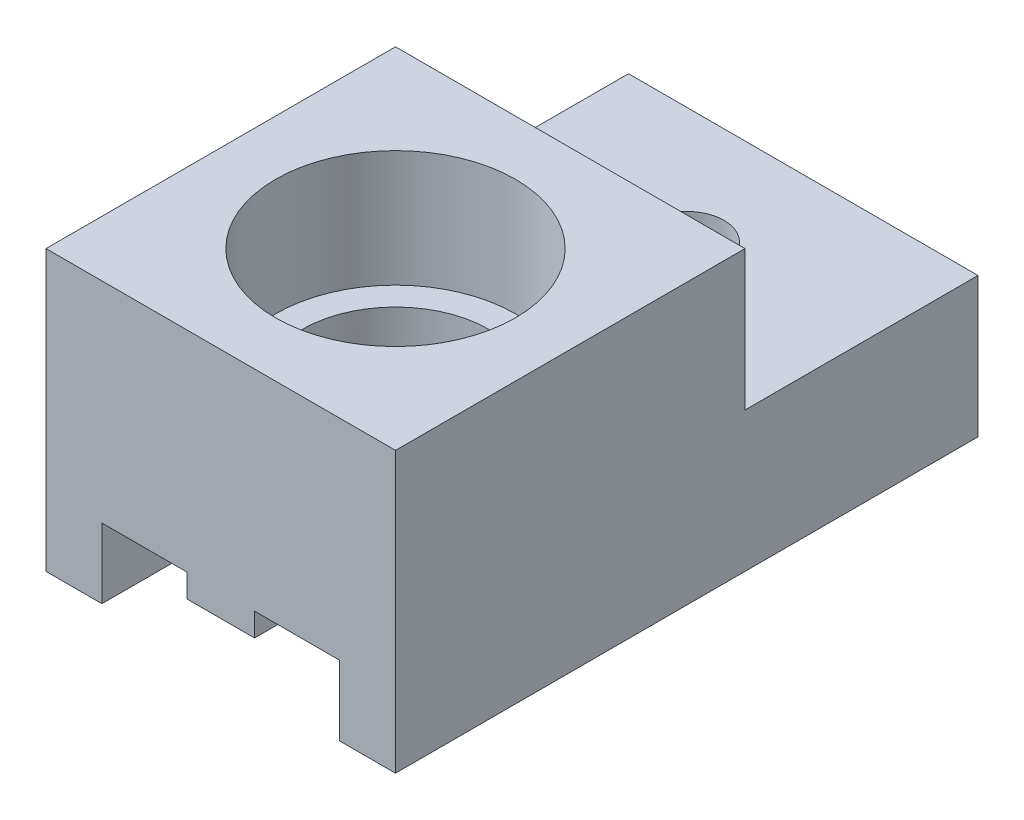
ISO-10303-21;
HEADER;
FILE_DESCRIPTION(('STEP AP214'),'2;1');
FILE_NAME('part.step','',(''),(''),'','','');
FILE_SCHEMA(('AUTOMOTIVE_DESIGN { 1 0 10303 214 1 1 1 1 }'));
ENDSEC;
DATA;
#1=APPLICATION_CONTEXT('core data for automotive mechanical design processes');
#2=APPLICATION_PROTOCOL_DEFINITION('international standard','automotive_design',2000,#1);
#3=PRODUCT_CONTEXT('',#1,'mechanical');
#4=PRODUCT('Part','Part','',(#3));
#5=PRODUCT_RELATED_PRODUCT_CATEGORY('part','',(#4));
#6=PRODUCT_DEFINITION_FORMATION('','',#4);
#7=PRODUCT_DEFINITION_CONTEXT('part definition',#1,'design');
#8=PRODUCT_DEFINITION('design','',#6,#7);
#9=PRODUCT_DEFINITION_SHAPE('','',#8);
#10=(LENGTH_UNIT() NAMED_UNIT(*) SI_UNIT(.MILLI.,.METRE.));
#11=(NAMED_UNIT(*) PLANE_ANGLE_UNIT() SI_UNIT($,.RADIAN.));
#12=(NAMED_UNIT(*) SI_UNIT($,.STERADIAN.) SOLID_ANGLE_UNIT());
#13=UNCERTAINTY_MEASURE_WITH_UNIT(LENGTH_MEASURE(1.E-05),#10,'distance_accuracy_value','');
#14=(GEOMETRIC_REPRESENTATION_CONTEXT(3) GLOBAL_UNCERTAINTY_ASSIGNED_CONTEXT((#13)) GLOBAL_UNIT_ASSIGNED_CONTEXT((#10,
#11,#12)) REPRESENTATION_CONTEXT('',''));
#15=CARTESIAN_POINT('',(0.,0.,0.));
#16=DIRECTION('',(0.,0.,1.));
#17=DIRECTION('',(1.,0.,0.));
#18=AXIS2_PLACEMENT_3D('',#15,#16,#17);
#19=CARTESIAN_POINT('',(-1.45,0.,25.));
#20=DIRECTION('',(1.,0.,0.));
#21=DIRECTION('',(0.,0.,-1.));
#22=AXIS2_PLACEMENT_3D('',#19,#20,#21);
#23=PLANE('',#22);
#24=DIRECTION('',(0.,0.,-1.));
#25=VECTOR('',#24,1.);
#26=CARTESIAN_POINT('',(-1.45,-1.,25.));
#27=LINE('',#26,#25);
#28=CARTESIAN_POINT('',(-1.45,-1.,4.32361253707657));
#29=VERTEX_POINT('',#28);
#30=CARTESIAN_POINT('',(-1.45,-1.,0.));
#31=VERTEX_POINT('',#30);
#32=EDGE_CURVE('E344',#29,#31,#27,.T.);
#33=ORIENTED_EDGE('',*,*,#32,.F.);
#34=DIRECTION('',(0.,1.,0.));
#35=VECTOR('',#34,1.);
#36=CARTESIAN_POINT('',(-1.45,-3.,4.32361253707657));
#37=LINE('',#36,#35);
#38=CARTESIAN_POINT('',(-1.45,0.,4.32361253707657));
#39=VERTEX_POINT('',#38);
#40=EDGE_CURVE('E226',#29,#39,#37,.T.);
#41=ORIENTED_EDGE('',*,*,#40,.T.);
#42=DIRECTION('',(0.,0.,-1.));
#43=VECTOR('',#42,1.);
#44=CARTESIAN_POINT('',(-1.45,0.,25.));
#45=LINE('',#44,#43);
#46=CARTESIAN_POINT('',(-1.45,0.,0.));
#47=VERTEX_POINT('',#46);
#48=EDGE_CURVE('E43',#39,#47,#45,.T.);
#49=ORIENTED_EDGE('',*,*,#48,.T.);
#50=DIRECTION('',(0.,-1.,0.));
#51=VECTOR('',#50,1.);
#52=CARTESIAN_POINT('',(-1.45,0.,0.));
#53=LINE('',#52,#51);
#54=EDGE_CURVE('E293',#47,#31,#53,.T.);
#55=ORIENTED_EDGE('',*,*,#54,.T.);
#56=EDGE_LOOP('',(#33,#41,#49,#55));
#57=FACE_BOUND('',#56,.T.);
#58=ADVANCED_FACE('F33',(#57),#23,.F.);
#59=CARTESIAN_POINT('',(-1.45,-1.,25.));
#60=DIRECTION('',(0.,1.,0.));
#61=DIRECTION('',(-1.,0.,0.));
#62=AXIS2_PLACEMENT_3D('',#59,#60,#61);
#63=PLANE('',#62);
#64=CARTESIAN_POINT('',(-1.45,-1.,13.7720649147283));
#65=VERTEX_POINT('',#64);
#66=CARTESIAN_POINT('',(-1.45,-1.,5.67638746292343));
#67=VERTEX_POINT('',#66);
#68=EDGE_CURVE('E348',#65,#67,#27,.T.);
#69=ORIENTED_EDGE('',*,*,#68,.T.);
#70=CARTESIAN_POINT('',(0.,-1.,5.));
#71=DIRECTION('',(0.,1.,0.));
#72=DIRECTION('',(-1.,0.,0.));
#73=AXIS2_PLACEMENT_3D('',#70,#71,#72);
#74=CIRCLE('',#73,1.6);
#75=CARTESIAN_POINT('',(1.45,-1.,5.67638746292343));
#76=VERTEX_POINT('',#75);
#77=EDGE_CURVE('E222',#67,#76,#74,.T.);
#78=ORIENTED_EDGE('',*,*,#77,.T.);
#79=DIRECTION('',(0.,0.,-1.));
#80=VECTOR('',#79,1.);
#81=CARTESIAN_POINT('',(1.45,-1.,25.));
#82=LINE('',#81,#80);
#83=CARTESIAN_POINT('',(1.45,-1.,13.7720649147283));
#84=VERTEX_POINT('',#83);
#85=EDGE_CURVE('E345',#84,#76,#82,.T.);
#86=ORIENTED_EDGE('',*,*,#85,.F.);
#87=CARTESIAN_POINT('',(0.,-1.,17.5));
#88=DIRECTION('',(0.,1.,0.));
#89=DIRECTION('',(-1.,0.,0.));
#90=AXIS2_PLACEMENT_3D('',#87,#88,#89);
#91=CIRCLE('',#90,4.);
#92=EDGE_CURVE('E244',#84,#65,#91,.T.);
#93=ORIENTED_EDGE('',*,*,#92,.T.);
#94=EDGE_LOOP('',(#69,#78,#86,#93));
#95=FACE_BOUND('',#94,.T.);
#96=ADVANCED_FACE('F379',(#95),#63,.F.);
#97=CARTESIAN_POINT('',(1.45,-1.,25.));
#98=DIRECTION('',(-1.,0.,0.));
#99=DIRECTION('',(0.,0.,1.));
#100=AXIS2_PLACEMENT_3D('',#97,#98,#99);
#101=PLANE('',#100);
#102=ORIENTED_EDGE('',*,*,#85,.T.);
#103=DIRECTION('',(0.,1.,0.));
#104=VECTOR('',#103,1.);
#105=CARTESIAN_POINT('',(1.45,-3.,5.67638746292343));
#106=LINE('',#105,#104);
#107=CARTESIAN_POINT('',(1.45,0.,5.67638746292343));
#108=VERTEX_POINT('',#107);
#109=EDGE_CURVE('E216',#76,#108,#106,.T.);
#110=ORIENTED_EDGE('',*,*,#109,.T.);
#111=DIRECTION('',(0.,0.,-1.));
#112=VECTOR('',#111,1.);
#113=CARTESIAN_POINT('',(1.45,0.,25.));
#114=LINE('',#113,#112);
#115=CARTESIAN_POINT('',(1.45,0.,13.7720649147283));
#116=VERTEX_POINT('',#115);
#117=EDGE_CURVE('E340',#116,#108,#114,.T.);
#118=ORIENTED_EDGE('',*,*,#117,.F.);
#119=DIRECTION('',(0.,1.,0.));
#120=VECTOR('',#119,1.);
#121=CARTESIAN_POINT('',(1.45,-3.,13.7720649147283));
#122=LINE('',#121,#120);
#123=EDGE_CURVE('E238',#116,#84,#122,.F.);
#124=ORIENTED_EDGE('',*,*,#123,.T.);
#125=EDGE_LOOP('',(#102,#110,#118,#124));
#126=FACE_BOUND('',#125,.T.);
#127=ADVANCED_FACE('F374',(#126),#101,.F.);
#128=CARTESIAN_POINT('',(-1.45,0.,13.7720649147283));
#129=VERTEX_POINT('',#128);
#130=CARTESIAN_POINT('',(-1.45,0.,5.67638746292343));
#131=VERTEX_POINT('',#130);
#132=EDGE_CURVE('E42',#129,#131,#45,.T.);
#133=ORIENTED_EDGE('',*,*,#132,.T.);
#134=DIRECTION('',(0.,1.,0.));
#135=VECTOR('',#134,1.);
#136=CARTESIAN_POINT('',(-1.45,-3.,5.67638746292343));
#137=LINE('',#136,#135);
#138=EDGE_CURVE('E223',#131,#67,#137,.F.);
#139=ORIENTED_EDGE('',*,*,#138,.T.);
#140=ORIENTED_EDGE('',*,*,#68,.F.);
#141=DIRECTION('',(0.,1.,0.));
#142=VECTOR('',#141,1.);
#143=CARTESIAN_POINT('',(-1.45,-3.,13.7720649147283));
#144=LINE('',#143,#142);
#145=EDGE_CURVE('E251',#65,#129,#144,.T.);
#146=ORIENTED_EDGE('',*,*,#145,.T.);
#147=EDGE_LOOP('',(#133,#139,#140,#146));
#148=FACE_BOUND('',#147,.T.);
#149=ADVANCED_FACE('F384',(#148),#23,.F.);
#150=CARTESIAN_POINT('',(-1.45,-1.,25.));
#151=VERTEX_POINT('',#150);
#152=CARTESIAN_POINT('',(-1.45,-1.,21.2279350852717));
#153=VERTEX_POINT('',#152);
#154=EDGE_CURVE('E346',#151,#153,#27,.T.);
#155=ORIENTED_EDGE('',*,*,#154,.T.);
#156=CARTESIAN_POINT('',(1.45,-1.,21.2279350852717));
#157=VERTEX_POINT('',#156);
#158=EDGE_CURVE('E247',#153,#157,#91,.T.);
#159=ORIENTED_EDGE('',*,*,#158,.T.);
#160=CARTESIAN_POINT('',(1.45,-1.,25.));
#161=VERTEX_POINT('',#160);
#162=EDGE_CURVE('E341',#161,#157,#82,.T.);
#163=ORIENTED_EDGE('',*,*,#162,.F.);
#164=DIRECTION('',(1.,0.,0.));
#165=VECTOR('',#164,1.);
#166=CARTESIAN_POINT('',(-1.45,-1.,25.));
#167=LINE('',#166,#165);
#168=EDGE_CURVE('E270',#151,#161,#167,.T.);
#169=ORIENTED_EDGE('',*,*,#168,.F.);
#170=EDGE_LOOP('',(#155,#159,#163,#169));
#171=FACE_BOUND('',#170,.T.);
#172=ADVANCED_FACE('F429',(#171),#63,.F.);
#173=ORIENTED_EDGE('',*,*,#162,.T.);
#174=DIRECTION('',(0.,1.,0.));
#175=VECTOR('',#174,1.);
#176=CARTESIAN_POINT('',(1.45,-3.,21.2279350852717));
#177=LINE('',#176,#175);
#178=CARTESIAN_POINT('',(1.45,0.,21.2279350852717));
#179=VERTEX_POINT('',#178);
#180=EDGE_CURVE('E241',#157,#179,#177,.T.);
#181=ORIENTED_EDGE('',*,*,#180,.T.);
#182=CARTESIAN_POINT('',(1.45,0.,25.));
#183=VERTEX_POINT('',#182);
#184=EDGE_CURVE('E336',#183,#179,#114,.T.);
#185=ORIENTED_EDGE('',*,*,#184,.F.);
#186=DIRECTION('',(0.,1.,0.));
#187=VECTOR('',#186,1.);
#188=CARTESIAN_POINT('',(1.45,-1.,25.));
#189=LINE('',#188,#187);
#190=EDGE_CURVE('E272',#161,#183,#189,.T.);
#191=ORIENTED_EDGE('',*,*,#190,.F.);
#192=EDGE_LOOP('',(#173,#181,#185,#191));
#193=FACE_BOUND('',#192,.T.);
#194=ADVANCED_FACE('F426',(#193),#101,.F.);
#195=CARTESIAN_POINT('',(-5.1,0.,25.));
#196=DIRECTION('',(0.,1.,0.));
#197=DIRECTION('',(0.,0.,1.));
#198=AXIS2_PLACEMENT_3D('',#195,#196,#197);
#199=PLANE('',#198);
#200=ORIENTED_EDGE('',*,*,#48,.F.);
#201=CARTESIAN_POINT('',(0.,0.,5.));
#202=DIRECTION('',(0.,1.,0.));
#203=DIRECTION('',(0.,0.,1.));
#204=AXIS2_PLACEMENT_3D('',#201,#202,#203);
#205=CIRCLE('',#204,1.6);
#206=EDGE_CURVE('E229',#39,#131,#205,.T.);
#207=ORIENTED_EDGE('',*,*,#206,.T.);
#208=ORIENTED_EDGE('',*,*,#132,.F.);
#209=CARTESIAN_POINT('',(0.,0.,17.5));
#210=DIRECTION('',(0.,1.,0.));
#211=DIRECTION('',(0.,0.,1.));
#212=AXIS2_PLACEMENT_3D('',#209,#210,#211);
#213=CIRCLE('',#212,4.);
#214=CARTESIAN_POINT('',(-1.45,0.,21.2279350852717));
#215=VERTEX_POINT('',#214);
#216=EDGE_CURVE('E254',#129,#215,#213,.T.);
#217=ORIENTED_EDGE('',*,*,#216,.T.);
#218=CARTESIAN_POINT('',(-1.45,0.,25.));
#219=VERTEX_POINT('',#218);
#220=EDGE_CURVE('E11',#219,#215,#45,.T.);
#221=ORIENTED_EDGE('',*,*,#220,.F.);
#222=DIRECTION('',(1.,0.,0.));
#223=VECTOR('',#222,1.);
#224=CARTESIAN_POINT('',(-5.1,0.,25.));
#225=LINE('',#224,#223);
#226=CARTESIAN_POINT('',(-5.1,0.,25.));
#227=VERTEX_POINT('',#226);
#228=EDGE_CURVE('E264',#227,#219,#225,.T.);
#229=ORIENTED_EDGE('',*,*,#228,.F.);
#230=DIRECTION('',(0.,0.,-1.));
#231=VECTOR('',#230,1.);
#232=CARTESIAN_POINT('',(-5.1,0.,25.));
#233=LINE('',#232,#231);
#234=CARTESIAN_POINT('',(-5.1,0.,0.));
#235=VERTEX_POINT('',#234);
#236=EDGE_CURVE('E290',#227,#235,#233,.T.);
#237=ORIENTED_EDGE('',*,*,#236,.T.);
#238=DIRECTION('',(1.,0.,0.));
#239=VECTOR('',#238,1.);
#240=CARTESIAN_POINT('',(-5.1,0.,0.));
#241=LINE('',#240,#239);
#242=EDGE_CURVE('E261',#235,#47,#241,.T.);
#243=ORIENTED_EDGE('',*,*,#242,.T.);
#244=EDGE_LOOP('',(#200,#207,#208,#217,#221,#229,#237,#243));
#245=FACE_BOUND('',#244,.T.);
#246=ADVANCED_FACE('F35',(#245),#199,.F.);
#247=ORIENTED_EDGE('',*,*,#220,.T.);
#248=DIRECTION('',(0.,1.,0.));
#249=VECTOR('',#248,1.);
#250=CARTESIAN_POINT('',(-1.45,-3.,21.2279350852717));
#251=LINE('',#250,#249);
#252=EDGE_CURVE('E248',#215,#153,#251,.F.);
#253=ORIENTED_EDGE('',*,*,#252,.T.);
#254=ORIENTED_EDGE('',*,*,#154,.F.);
#255=DIRECTION('',(0.,-1.,0.));
#256=VECTOR('',#255,1.);
#257=CARTESIAN_POINT('',(-1.45,0.,25.));
#258=LINE('',#257,#256);
#259=EDGE_CURVE('E267',#219,#151,#258,.T.);
#260=ORIENTED_EDGE('',*,*,#259,.F.);
#261=EDGE_LOOP('',(#247,#253,#254,#260));
#262=FACE_BOUND('',#261,.T.);
#263=ADVANCED_FACE('F431',(#262),#23,.F.);
#264=CARTESIAN_POINT('',(1.45,-1.,4.32361253707657));
#265=VERTEX_POINT('',#264);
#266=CARTESIAN_POINT('',(1.45,-1.,0.));
#267=VERTEX_POINT('',#266);
#268=EDGE_CURVE('E339',#265,#267,#82,.T.);
#269=ORIENTED_EDGE('',*,*,#268,.F.);
#270=EDGE_CURVE('E219',#265,#29,#74,.T.);
#271=ORIENTED_EDGE('',*,*,#270,.T.);
#272=ORIENTED_EDGE('',*,*,#32,.T.);
#273=DIRECTION('',(1.,0.,0.));
#274=VECTOR('',#273,1.);
#275=CARTESIAN_POINT('',(-1.45,-1.,0.));
#276=LINE('',#275,#274);
#277=EDGE_CURVE('E296',#31,#267,#276,.T.);
#278=ORIENTED_EDGE('',*,*,#277,.T.);
#279=EDGE_LOOP('',(#269,#271,#272,#278));
#280=FACE_BOUND('',#279,.T.);
#281=ADVANCED_FACE('F357',(#280),#63,.F.);
#282=CARTESIAN_POINT('',(1.45,0.,4.32361253707657));
#283=VERTEX_POINT('',#282);
#284=CARTESIAN_POINT('',(1.45,0.,0.));
#285=VERTEX_POINT('',#284);
#286=EDGE_CURVE('E335',#283,#285,#114,.T.);
#287=ORIENTED_EDGE('',*,*,#286,.F.);
#288=DIRECTION('',(0.,1.,0.));
#289=VECTOR('',#288,1.);
#290=CARTESIAN_POINT('',(1.45,-3.,4.32361253707657));
#291=LINE('',#290,#289);
#292=EDGE_CURVE('E58',#283,#265,#291,.F.);
#293=ORIENTED_EDGE('',*,*,#292,.T.);
#294=ORIENTED_EDGE('',*,*,#268,.T.);
#295=DIRECTION('',(0.,1.,0.));
#296=VECTOR('',#295,1.);
#297=CARTESIAN_POINT('',(1.45,-1.,0.));
#298=LINE('',#297,#296);
#299=EDGE_CURVE('E299',#267,#285,#298,.T.);
#300=ORIENTED_EDGE('',*,*,#299,.T.);
#301=EDGE_LOOP('',(#287,#293,#294,#300));
#302=FACE_BOUND('',#301,.T.);
#303=ADVANCED_FACE('F370',(#302),#101,.F.);
#304=CARTESIAN_POINT('',(1.45,0.,25.));
#305=DIRECTION('',(0.,1.,0.));
#306=DIRECTION('',(0.,0.,1.));
#307=AXIS2_PLACEMENT_3D('',#304,#305,#306);
#308=PLANE('',#307);
#309=ORIENTED_EDGE('',*,*,#117,.T.);
#310=CARTESIAN_POINT('',(0.,0.,5.));
#311=DIRECTION('',(0.,1.,0.));
#312=DIRECTION('',(0.,0.,1.));
#313=AXIS2_PLACEMENT_3D('',#310,#311,#312);
#314=CIRCLE('',#313,1.6);
#315=EDGE_CURVE('E213',#108,#283,#314,.T.);
#316=ORIENTED_EDGE('',*,*,#315,.T.);
#317=ORIENTED_EDGE('',*,*,#286,.T.);
#318=DIRECTION('',(1.,0.,0.));
#319=VECTOR('',#318,1.);
#320=CARTESIAN_POINT('',(1.45,0.,0.));
#321=LINE('',#320,#319);
#322=CARTESIAN_POINT('',(5.1,0.,0.));
#323=VERTEX_POINT('',#322);
#324=EDGE_CURVE('E302',#285,#323,#321,.T.);
#325=ORIENTED_EDGE('',*,*,#324,.T.);
#326=DIRECTION('',(0.,0.,-1.));
#327=VECTOR('',#326,1.);
#328=CARTESIAN_POINT('',(5.1,0.,25.));
#329=LINE('',#328,#327);
#330=CARTESIAN_POINT('',(5.1,0.,25.));
#331=VERTEX_POINT('',#330);
#332=EDGE_CURVE('E332',#331,#323,#329,.T.);
#333=ORIENTED_EDGE('',*,*,#332,.F.);
#334=DIRECTION('',(1.,0.,0.));
#335=VECTOR('',#334,1.);
#336=CARTESIAN_POINT('',(1.45,0.,25.));
#337=LINE('',#336,#335);
#338=EDGE_CURVE('E274',#183,#331,#337,.T.);
#339=ORIENTED_EDGE('',*,*,#338,.F.);
#340=ORIENTED_EDGE('',*,*,#184,.T.);
#341=CARTESIAN_POINT('',(0.,0.,17.5));
#342=DIRECTION('',(0.,1.,0.));
#343=DIRECTION('',(0.,0.,1.));
#344=AXIS2_PLACEMENT_3D('',#341,#342,#343);
#345=CIRCLE('',#344,4.);
#346=EDGE_CURVE('E235',#179,#116,#345,.T.);
#347=ORIENTED_EDGE('',*,*,#346,.T.);
#348=EDGE_LOOP('',(#309,#316,#317,#325,#333,#339,#340,#347));
#349=FACE_BOUND('',#348,.T.);
#350=ADVANCED_FACE('F421',(#349),#308,.F.);
#351=CARTESIAN_POINT('',(5.1,0.,25.));
#352=DIRECTION('',(1.,0.,0.));
#353=DIRECTION('',(0.,0.,-1.));
#354=AXIS2_PLACEMENT_3D('',#351,#352,#353);
#355=PLANE('',#354);
#356=DIRECTION('',(0.,-1.,0.));
#357=VECTOR('',#356,1.);
#358=CARTESIAN_POINT('',(5.1,0.,0.));
#359=LINE('',#358,#357);
#360=CARTESIAN_POINT('',(5.1,-3.,0.));
#361=VERTEX_POINT('',#360);
#362=EDGE_CURVE('E304',#323,#361,#359,.T.);
#363=ORIENTED_EDGE('',*,*,#362,.T.);
#364=DIRECTION('',(0.,0.,-1.));
#365=VECTOR('',#364,1.);
#366=CARTESIAN_POINT('',(5.1,-3.,25.));
#367=LINE('',#366,#365);
#368=CARTESIAN_POINT('',(5.1,-3.,25.));
#369=VERTEX_POINT('',#368);
#370=EDGE_CURVE('E329',#369,#361,#367,.T.);
#371=ORIENTED_EDGE('',*,*,#370,.F.);
#372=DIRECTION('',(0.,-1.,0.));
#373=VECTOR('',#372,1.);
#374=CARTESIAN_POINT('',(5.1,0.,25.));
#375=LINE('',#374,#373);
#376=EDGE_CURVE('E276',#331,#369,#375,.T.);
#377=ORIENTED_EDGE('',*,*,#376,.F.);
#378=ORIENTED_EDGE('',*,*,#332,.T.);
#379=EDGE_LOOP('',(#363,#371,#377,#378));
#380=FACE_BOUND('',#379,.T.);
#381=ADVANCED_FACE('F419',(#380),#355,.F.);
#382=CARTESIAN_POINT('',(5.1,-3.,25.));
#383=DIRECTION('',(0.,1.,0.));
#384=DIRECTION('',(-1.,0.,0.));
#385=AXIS2_PLACEMENT_3D('',#382,#383,#384);
#386=PLANE('',#385);
#387=DIRECTION('',(1.,0.,0.));
#388=VECTOR('',#387,1.);
#389=CARTESIAN_POINT('',(5.1,-3.,0.));
#390=LINE('',#389,#388);
#391=CARTESIAN_POINT('',(7.5,-3.,0.));
#392=VERTEX_POINT('',#391);
#393=EDGE_CURVE('E306',#361,#392,#390,.T.);
#394=ORIENTED_EDGE('',*,*,#393,.T.);
#395=DIRECTION('',(0.,0.,-1.));
#396=VECTOR('',#395,1.);
#397=CARTESIAN_POINT('',(7.5,-3.,25.));
#398=LINE('',#397,#396);
#399=CARTESIAN_POINT('',(7.5,-3.,25.));
#400=VERTEX_POINT('',#399);
#401=EDGE_CURVE('E327',#400,#392,#398,.T.);
#402=ORIENTED_EDGE('',*,*,#401,.F.);
#403=DIRECTION('',(1.,0.,0.));
#404=VECTOR('',#403,1.);
#405=CARTESIAN_POINT('',(5.1,-3.,25.));
#406=LINE('',#405,#404);
#407=EDGE_CURVE('E278',#369,#400,#406,.T.);
#408=ORIENTED_EDGE('',*,*,#407,.F.);
#409=ORIENTED_EDGE('',*,*,#370,.T.);
#410=EDGE_LOOP('',(#394,#402,#408,#409));
#411=FACE_BOUND('',#410,.T.);
#412=ADVANCED_FACE('F407',(#411),#386,.F.);
#413=CARTESIAN_POINT('',(7.5,-3.,25.));
#414=DIRECTION('',(-1.,0.,0.));
#415=DIRECTION('',(0.,0.,1.));
#416=AXIS2_PLACEMENT_3D('',#413,#414,#415);
#417=PLANE('',#416);
#418=DIRECTION('',(0.,0.,1.));
#419=VECTOR('',#418,1.);
#420=CARTESIAN_POINT('',(7.5,3.,0.));
#421=LINE('',#420,#419);
#422=CARTESIAN_POINT('',(7.5,3.,0.));
#423=VERTEX_POINT('',#422);
#424=CARTESIAN_POINT('',(7.5,3.,10.));
#425=VERTEX_POINT('',#424);
#426=EDGE_CURVE('E50',#423,#425,#421,.T.);
#427=ORIENTED_EDGE('',*,*,#426,.T.);
#428=DIRECTION('',(0.,1.,0.));
#429=VECTOR('',#428,1.);
#430=CARTESIAN_POINT('',(7.5,9.,10.));
#431=LINE('',#430,#429);
#432=CARTESIAN_POINT('',(7.5,9.,10.));
#433=VERTEX_POINT('',#432);
#434=EDGE_CURVE('E194',#425,#433,#431,.T.);
#435=ORIENTED_EDGE('',*,*,#434,.T.);
#436=DIRECTION('',(0.,0.,-1.));
#437=VECTOR('',#436,1.);
#438=CARTESIAN_POINT('',(7.5,9.,25.));
#439=LINE('',#438,#437);
#440=CARTESIAN_POINT('',(7.5,9.,25.));
#441=VERTEX_POINT('',#440);
#442=EDGE_CURVE('E325',#441,#433,#439,.T.);
#443=ORIENTED_EDGE('',*,*,#442,.F.);
#444=DIRECTION('',(0.,1.,0.));
#445=VECTOR('',#444,1.);
#446=CARTESIAN_POINT('',(7.5,-3.,25.));
#447=LINE('',#446,#445);
#448=EDGE_CURVE('E280',#400,#441,#447,.T.);
#449=ORIENTED_EDGE('',*,*,#448,.F.);
#450=ORIENTED_EDGE('',*,*,#401,.T.);
#451=DIRECTION('',(0.,1.,0.));
#452=VECTOR('',#451,1.);
#453=CARTESIAN_POINT('',(7.5,-3.,0.));
#454=LINE('',#453,#452);
#455=EDGE_CURVE('E205',#392,#423,#454,.T.);
#456=ORIENTED_EDGE('',*,*,#455,.T.);
#457=EDGE_LOOP('',(#427,#435,#443,#449,#450,#456));
#458=FACE_BOUND('',#457,.T.);
#459=ADVANCED_FACE('F202',(#458),#417,.F.);
#460=CARTESIAN_POINT('',(7.5,9.,25.));
#461=DIRECTION('',(0.,-1.,0.));
#462=DIRECTION('',(0.,0.,-1.));
#463=AXIS2_PLACEMENT_3D('',#460,#461,#462);
#464=PLANE('',#463);
#465=CARTESIAN_POINT('',(0.,9.,17.5));
#466=DIRECTION('',(0.,1.,0.));
#467=DIRECTION('',(-1.,0.,0.));
#468=AXIS2_PLACEMENT_3D('',#465,#466,#467);
#469=CIRCLE('',#468,5.15);
#470=CARTESIAN_POINT('',(-5.15,9.,17.5));
#471=VERTEX_POINT('',#470);
#472=EDGE_CURVE('E257',#471,#471,#469,.T.);
#473=ORIENTED_EDGE('',*,*,#472,.F.);
#474=EDGE_LOOP('',(#473));
#475=FACE_BOUND('',#474,.T.);
#476=ORIENTED_EDGE('',*,*,#442,.T.);
#477=DIRECTION('',(-1.,0.,0.));
#478=VECTOR('',#477,1.);
#479=CARTESIAN_POINT('',(7.5,9.,10.));
#480=LINE('',#479,#478);
#481=CARTESIAN_POINT('',(-7.5,9.,10.));
#482=VERTEX_POINT('',#481);
#483=EDGE_CURVE('E190',#433,#482,#480,.T.);
#484=ORIENTED_EDGE('',*,*,#483,.T.);
#485=DIRECTION('',(0.,0.,-1.));
#486=VECTOR('',#485,1.);
#487=CARTESIAN_POINT('',(-7.5,9.,25.));
#488=LINE('',#487,#486);
#489=CARTESIAN_POINT('',(-7.5,9.,25.));
#490=VERTEX_POINT('',#489);
#491=EDGE_CURVE('E322',#490,#482,#488,.T.);
#492=ORIENTED_EDGE('',*,*,#491,.F.);
#493=DIRECTION('',(-1.,0.,0.));
#494=VECTOR('',#493,1.);
#495=CARTESIAN_POINT('',(7.5,9.,25.));
#496=LINE('',#495,#494);
#497=EDGE_CURVE('E282',#441,#490,#496,.T.);
#498=ORIENTED_EDGE('',*,*,#497,.F.);
#499=EDGE_LOOP('',(#476,#484,#492,#498));
#500=FACE_BOUND('',#499,.T.);
#501=ADVANCED_FACE('F463',(#475,#500),#464,.F.);
#502=CARTESIAN_POINT('',(-7.5,-3.,25.));
#503=DIRECTION('',(1.,0.,0.));
#504=DIRECTION('',(0.,0.,-1.));
#505=AXIS2_PLACEMENT_3D('',#502,#503,#504);
#506=PLANE('',#505);
#507=ORIENTED_EDGE('',*,*,#491,.T.);
#508=DIRECTION('',(0.,1.,0.));
#509=VECTOR('',#508,1.);
#510=CARTESIAN_POINT('',(-7.5,9.,10.));
#511=LINE('',#510,#509);
#512=CARTESIAN_POINT('',(-7.5,3.,10.));
#513=VERTEX_POINT('',#512);
#514=EDGE_CURVE('E206',#513,#482,#511,.T.);
#515=ORIENTED_EDGE('',*,*,#514,.F.);
#516=DIRECTION('',(0.,0.,1.));
#517=VECTOR('',#516,1.);
#518=CARTESIAN_POINT('',(-7.5,3.,0.));
#519=LINE('',#518,#517);
#520=CARTESIAN_POINT('',(-7.5,3.,0.));
#521=VERTEX_POINT('',#520);
#522=EDGE_CURVE('E187',#521,#513,#519,.T.);
#523=ORIENTED_EDGE('',*,*,#522,.F.);
#524=DIRECTION('',(0.,-1.,0.));
#525=VECTOR('',#524,1.);
#526=CARTESIAN_POINT('',(-7.5,-3.,0.));
#527=LINE('',#526,#525);
#528=CARTESIAN_POINT('',(-7.5,-3.,0.));
#529=VERTEX_POINT('',#528);
#530=EDGE_CURVE('E309',#521,#529,#527,.T.);
#531=ORIENTED_EDGE('',*,*,#530,.T.);
#532=DIRECTION('',(0.,0.,-1.));
#533=VECTOR('',#532,1.);
#534=CARTESIAN_POINT('',(-7.5,-3.,25.));
#535=LINE('',#534,#533);
#536=CARTESIAN_POINT('',(-7.5,-3.,25.));
#537=VERTEX_POINT('',#536);
#538=EDGE_CURVE('E319',#537,#529,#535,.T.);
#539=ORIENTED_EDGE('',*,*,#538,.F.);
#540=DIRECTION('',(0.,-1.,0.));
#541=VECTOR('',#540,1.);
#542=CARTESIAN_POINT('',(-7.5,-3.,25.));
#543=LINE('',#542,#541);
#544=EDGE_CURVE('E284',#490,#537,#543,.T.);
#545=ORIENTED_EDGE('',*,*,#544,.F.);
#546=EDGE_LOOP('',(#507,#515,#523,#531,#539,#545));
#547=FACE_BOUND('',#546,.T.);
#548=ADVANCED_FACE('F403',(#547),#506,.F.);
#549=CARTESIAN_POINT('',(-5.1,-3.,25.));
#550=DIRECTION('',(0.,1.,0.));
#551=DIRECTION('',(-1.,0.,0.));
#552=AXIS2_PLACEMENT_3D('',#549,#550,#551);
#553=PLANE('',#552);
#554=DIRECTION('',(1.,0.,0.));
#555=VECTOR('',#554,1.);
#556=CARTESIAN_POINT('',(-5.1,-3.,0.));
#557=LINE('',#556,#555);
#558=CARTESIAN_POINT('',(-5.1,-3.,0.));
#559=VERTEX_POINT('',#558);
#560=EDGE_CURVE('E311',#529,#559,#557,.T.);
#561=ORIENTED_EDGE('',*,*,#560,.T.);
#562=DIRECTION('',(0.,0.,-1.));
#563=VECTOR('',#562,1.);
#564=CARTESIAN_POINT('',(-5.1,-3.,25.));
#565=LINE('',#564,#563);
#566=CARTESIAN_POINT('',(-5.1,-3.,25.));
#567=VERTEX_POINT('',#566);
#568=EDGE_CURVE('E316',#567,#559,#565,.T.);
#569=ORIENTED_EDGE('',*,*,#568,.F.);
#570=DIRECTION('',(1.,0.,0.));
#571=VECTOR('',#570,1.);
#572=CARTESIAN_POINT('',(-5.1,-3.,25.));
#573=LINE('',#572,#571);
#574=EDGE_CURVE('E286',#537,#567,#573,.T.);
#575=ORIENTED_EDGE('',*,*,#574,.F.);
#576=ORIENTED_EDGE('',*,*,#538,.T.);
#577=EDGE_LOOP('',(#561,#569,#575,#576));
#578=FACE_BOUND('',#577,.T.);
#579=ADVANCED_FACE('F399',(#578),#553,.F.);
#580=CARTESIAN_POINT('',(-5.1,0.,25.));
#581=DIRECTION('',(-1.,0.,0.));
#582=DIRECTION('',(0.,0.,1.));
#583=AXIS2_PLACEMENT_3D('',#580,#581,#582);
#584=PLANE('',#583);
#585=DIRECTION('',(0.,1.,0.));
#586=VECTOR('',#585,1.);
#587=CARTESIAN_POINT('',(-5.1,0.,0.));
#588=LINE('',#587,#586);
#589=EDGE_CURVE('E268',#559,#235,#588,.T.);
#590=ORIENTED_EDGE('',*,*,#589,.T.);
#591=ORIENTED_EDGE('',*,*,#236,.F.);
#592=DIRECTION('',(0.,1.,0.));
#593=VECTOR('',#592,1.);
#594=CARTESIAN_POINT('',(-5.1,0.,25.));
#595=LINE('',#594,#593);
#596=EDGE_CURVE('E288',#567,#227,#595,.T.);
#597=ORIENTED_EDGE('',*,*,#596,.F.);
#598=ORIENTED_EDGE('',*,*,#568,.T.);
#599=EDGE_LOOP('',(#590,#591,#597,#598));
#600=FACE_BOUND('',#599,.T.);
#601=ADVANCED_FACE('F394',(#600),#584,.F.);
#602=CARTESIAN_POINT('',(0.,0.,25.));
#603=DIRECTION('',(0.,0.,-1.));
#604=DIRECTION('',(-1.,0.,0.));
#605=AXIS2_PLACEMENT_3D('',#602,#603,#604);
#606=PLANE('',#605);
#607=ORIENTED_EDGE('',*,*,#228,.T.);
#608=ORIENTED_EDGE('',*,*,#259,.T.);
#609=ORIENTED_EDGE('',*,*,#168,.T.);
#610=ORIENTED_EDGE('',*,*,#190,.T.);
#611=ORIENTED_EDGE('',*,*,#338,.T.);
#612=ORIENTED_EDGE('',*,*,#376,.T.);
#613=ORIENTED_EDGE('',*,*,#407,.T.);
#614=ORIENTED_EDGE('',*,*,#448,.T.);
#615=ORIENTED_EDGE('',*,*,#497,.T.);
#616=ORIENTED_EDGE('',*,*,#544,.T.);
#617=ORIENTED_EDGE('',*,*,#574,.T.);
#618=ORIENTED_EDGE('',*,*,#596,.T.);
#619=EDGE_LOOP('',(#607,#608,#609,#610,#611,#612,#613,#614,#615,#616,#617,#618));
#620=FACE_BOUND('',#619,.T.);
#621=ADVANCED_FACE('F413',(#620),#606,.F.);
#622=CARTESIAN_POINT('',(0.,0.,0.));
#623=DIRECTION('',(0.,0.,-1.));
#624=DIRECTION('',(-1.,0.,0.));
#625=AXIS2_PLACEMENT_3D('',#622,#623,#624);
#626=PLANE('',#625);
#627=DIRECTION('',(-1.,0.,0.));
#628=VECTOR('',#627,1.);
#629=CARTESIAN_POINT('',(7.5,3.,0.));
#630=LINE('',#629,#628);
#631=EDGE_CURVE('E191',#423,#521,#630,.T.);
#632=ORIENTED_EDGE('',*,*,#631,.F.);
#633=ORIENTED_EDGE('',*,*,#455,.F.);
#634=ORIENTED_EDGE('',*,*,#393,.F.);
#635=ORIENTED_EDGE('',*,*,#362,.F.);
#636=ORIENTED_EDGE('',*,*,#324,.F.);
#637=ORIENTED_EDGE('',*,*,#299,.F.);
#638=ORIENTED_EDGE('',*,*,#277,.F.);
#639=ORIENTED_EDGE('',*,*,#54,.F.);
#640=ORIENTED_EDGE('',*,*,#242,.F.);
#641=ORIENTED_EDGE('',*,*,#589,.F.);
#642=ORIENTED_EDGE('',*,*,#560,.F.);
#643=ORIENTED_EDGE('',*,*,#530,.F.);
#644=EDGE_LOOP('',(#632,#633,#634,#635,#636,#637,#638,#639,#640,#641,#642,#643));
#645=FACE_BOUND('',#644,.T.);
#646=ADVANCED_FACE('F365',(#645),#626,.T.);
#647=CARTESIAN_POINT('',(0.,4.,17.5));
#648=DIRECTION('',(0.,1.,0.));
#649=DIRECTION('',(-1.,0.,0.));
#650=AXIS2_PLACEMENT_3D('',#647,#648,#649);
#651=CYLINDRICAL_SURFACE('',#650,5.15);
#652=CARTESIAN_POINT('',(0.,4.,17.5));
#653=DIRECTION('',(0.,1.,0.));
#654=DIRECTION('',(-1.,0.,0.));
#655=AXIS2_PLACEMENT_3D('',#652,#653,#654);
#656=CIRCLE('',#655,5.15);
#657=CARTESIAN_POINT('',(-5.15,4.,17.5));
#658=VERTEX_POINT('',#657);
#659=EDGE_CURVE('E258',#658,#658,#656,.T.);
#660=ORIENTED_EDGE('',*,*,#659,.F.);
#661=EDGE_LOOP('',(#660));
#662=FACE_BOUND('',#661,.T.);
#663=ORIENTED_EDGE('',*,*,#472,.T.);
#664=EDGE_LOOP('',(#663));
#665=FACE_BOUND('',#664,.T.);
#666=ADVANCED_FACE('F475',(#662,#665),#651,.F.);
#667=CARTESIAN_POINT('',(0.,4.,17.5));
#668=DIRECTION('',(0.,1.,0.));
#669=DIRECTION('',(-1.,0.,0.));
#670=AXIS2_PLACEMENT_3D('',#667,#668,#669);
#671=PLANE('',#670);
#672=CARTESIAN_POINT('',(0.,4.,17.5));
#673=DIRECTION('',(0.,1.,0.));
#674=DIRECTION('',(-1.,0.,0.));
#675=AXIS2_PLACEMENT_3D('',#672,#673,#674);
#676=CIRCLE('',#675,4.);
#677=CARTESIAN_POINT('',(-4.,4.,17.5));
#678=VERTEX_POINT('',#677);
#679=EDGE_CURVE('E232',#678,#678,#676,.T.);
#680=ORIENTED_EDGE('',*,*,#679,.F.);
#681=EDGE_LOOP('',(#680));
#682=FACE_BOUND('',#681,.T.);
#683=ORIENTED_EDGE('',*,*,#659,.T.);
#684=EDGE_LOOP('',(#683));
#685=FACE_BOUND('',#684,.T.);
#686=ADVANCED_FACE('F480',(#682,#685),#671,.T.);
#687=CARTESIAN_POINT('',(0.,-3.,17.5));
#688=DIRECTION('',(0.,1.,0.));
#689=DIRECTION('',(-1.,0.,0.));
#690=AXIS2_PLACEMENT_3D('',#687,#688,#689);
#691=CYLINDRICAL_SURFACE('',#690,4.);
#692=ORIENTED_EDGE('',*,*,#679,.T.);
#693=EDGE_LOOP('',(#692));
#694=FACE_BOUND('',#693,.T.);
#695=ORIENTED_EDGE('',*,*,#145,.F.);
#696=ORIENTED_EDGE('',*,*,#92,.F.);
#697=ORIENTED_EDGE('',*,*,#123,.F.);
#698=ORIENTED_EDGE('',*,*,#346,.F.);
#699=ORIENTED_EDGE('',*,*,#180,.F.);
#700=ORIENTED_EDGE('',*,*,#158,.F.);
#701=ORIENTED_EDGE('',*,*,#252,.F.);
#702=ORIENTED_EDGE('',*,*,#216,.F.);
#703=EDGE_LOOP('',(#695,#696,#697,#698,#699,#700,#701,#702));
#704=FACE_BOUND('',#703,.T.);
#705=ADVANCED_FACE('F424',(#694,#704),#691,.F.);
#706=CARTESIAN_POINT('',(0.,-3.,5.));
#707=DIRECTION('',(0.,1.,0.));
#708=DIRECTION('',(0.,0.,1.));
#709=AXIS2_PLACEMENT_3D('',#706,#707,#708);
#710=CYLINDRICAL_SURFACE('',#709,1.6);
#711=CARTESIAN_POINT('',(0.,3.,5.));
#712=DIRECTION('',(0.,-1.,0.));
#713=DIRECTION('',(0.,0.,-1.));
#714=AXIS2_PLACEMENT_3D('',#711,#712,#713);
#715=CIRCLE('',#714,1.6);
#716=CARTESIAN_POINT('',(0.,3.,3.4));
#717=VERTEX_POINT('',#716);
#718=EDGE_CURVE('E37',#717,#717,#715,.F.);
#719=ORIENTED_EDGE('',*,*,#718,.T.);
#720=EDGE_LOOP('',(#719));
#721=FACE_BOUND('',#720,.T.);
#722=ORIENTED_EDGE('',*,*,#40,.F.);
#723=ORIENTED_EDGE('',*,*,#270,.F.);
#724=ORIENTED_EDGE('',*,*,#292,.F.);
#725=ORIENTED_EDGE('',*,*,#315,.F.);
#726=ORIENTED_EDGE('',*,*,#109,.F.);
#727=ORIENTED_EDGE('',*,*,#77,.F.);
#728=ORIENTED_EDGE('',*,*,#138,.F.);
#729=ORIENTED_EDGE('',*,*,#206,.F.);
#730=EDGE_LOOP('',(#722,#723,#724,#725,#726,#727,#728,#729));
#731=FACE_BOUND('',#730,.T.);
#732=ADVANCED_FACE('F381',(#721,#731),#710,.F.);
#733=CARTESIAN_POINT('',(7.5,3.,0.));
#734=DIRECTION('',(0.,-1.,0.));
#735=DIRECTION('',(0.,0.,-1.));
#736=AXIS2_PLACEMENT_3D('',#733,#734,#735);
#737=PLANE('',#736);
#738=ORIENTED_EDGE('',*,*,#522,.T.);
#739=DIRECTION('',(-1.,0.,0.));
#740=VECTOR('',#739,1.);
#741=CARTESIAN_POINT('',(7.5,3.,10.));
#742=LINE('',#741,#740);
#743=EDGE_CURVE('E182',#425,#513,#742,.T.);
#744=ORIENTED_EDGE('',*,*,#743,.F.);
#745=ORIENTED_EDGE('',*,*,#426,.F.);
#746=ORIENTED_EDGE('',*,*,#631,.T.);
#747=EDGE_LOOP('',(#738,#744,#745,#746));
#748=FACE_BOUND('',#747,.T.);
#749=ORIENTED_EDGE('',*,*,#718,.F.);
#750=EDGE_LOOP('',(#749));
#751=FACE_BOUND('',#750,.T.);
#752=ADVANCED_FACE('F184',(#748,#751),#737,.F.);
#753=CARTESIAN_POINT('',(7.5,9.,10.));
#754=DIRECTION('',(0.,0.,1.));
#755=DIRECTION('',(1.,0.,0.));
#756=AXIS2_PLACEMENT_3D('',#753,#754,#755);
#757=PLANE('',#756);
#758=ORIENTED_EDGE('',*,*,#514,.T.);
#759=ORIENTED_EDGE('',*,*,#483,.F.);
#760=ORIENTED_EDGE('',*,*,#434,.F.);
#761=ORIENTED_EDGE('',*,*,#743,.T.);
#762=EDGE_LOOP('',(#758,#759,#760,#761));
#763=FACE_BOUND('',#762,.T.);
#764=ADVANCED_FACE('F195',(#763),#757,.F.);
#765=CLOSED_SHELL('',(#58,#96,#127,#149,#172,#194,#246,#263,#281,#303,#350,#381,#412,#459,#501,
#548,#579,#601,#621,#646,#666,#686,#705,#732,#752,#764));
#766=MANIFOLD_SOLID_BREP('B2',#765);
#767=ADVANCED_BREP_SHAPE_REPRESENTATION('',(#18,#766),#14);
#768=SHAPE_DEFINITION_REPRESENTATION(#9,#767);
ENDSEC;
END-ISO-10303-21;
